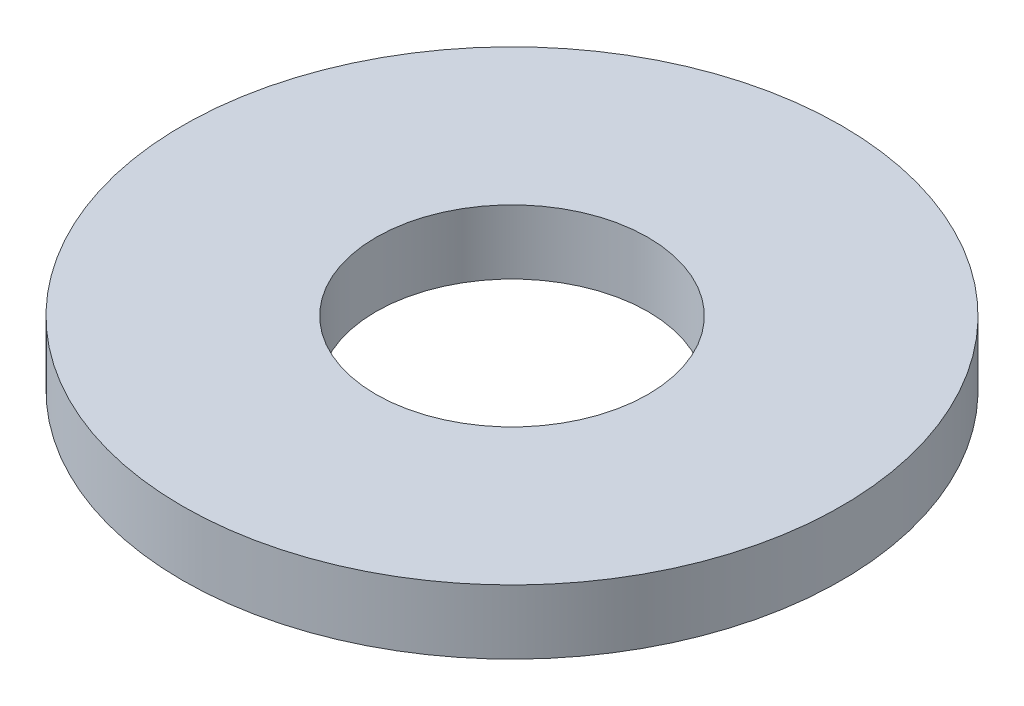
ISO-10303-21;
HEADER;
FILE_DESCRIPTION(('STEP AP214'),'2;1');
FILE_NAME('part.step','',(''),(''),'','','');
FILE_SCHEMA(('AUTOMOTIVE_DESIGN { 1 0 10303 214 1 1 1 1 }'));
ENDSEC;
DATA;
#1=APPLICATION_CONTEXT('core data for automotive mechanical design processes');
#2=APPLICATION_PROTOCOL_DEFINITION('international standard','automotive_design',2000,#1);
#3=PRODUCT_CONTEXT('',#1,'mechanical');
#4=PRODUCT('Part','Part','',(#3));
#5=PRODUCT_RELATED_PRODUCT_CATEGORY('part','',(#4));
#6=PRODUCT_DEFINITION_FORMATION('','',#4);
#7=PRODUCT_DEFINITION_CONTEXT('part definition',#1,'design');
#8=PRODUCT_DEFINITION('design','',#6,#7);
#9=PRODUCT_DEFINITION_SHAPE('','',#8);
#10=(LENGTH_UNIT() NAMED_UNIT(*) SI_UNIT(.MILLI.,.METRE.));
#11=(NAMED_UNIT(*) PLANE_ANGLE_UNIT() SI_UNIT($,.RADIAN.));
#12=(NAMED_UNIT(*) SI_UNIT($,.STERADIAN.) SOLID_ANGLE_UNIT());
#13=UNCERTAINTY_MEASURE_WITH_UNIT(LENGTH_MEASURE(1.E-05),#10,'distance_accuracy_value','');
#14=(GEOMETRIC_REPRESENTATION_CONTEXT(3) GLOBAL_UNCERTAINTY_ASSIGNED_CONTEXT((#13)) GLOBAL_UNIT_ASSIGNED_CONTEXT((#10,
#11,#12)) REPRESENTATION_CONTEXT('',''));
#15=CARTESIAN_POINT('',(0.,0.,0.));
#16=DIRECTION('',(0.,0.,1.));
#17=DIRECTION('',(1.,0.,0.));
#18=AXIS2_PLACEMENT_3D('',#15,#16,#17);
#19=CARTESIAN_POINT('',(0.,1.56,0.));
#20=DIRECTION('',(0.,1.,0.));
#21=DIRECTION('',(0.,0.,-1.));
#22=AXIS2_PLACEMENT_3D('',#19,#20,#21);
#23=PLANE('',#22);
#24=CARTESIAN_POINT('',(0.,1.56,0.));
#25=DIRECTION('',(0.,-1.,0.));
#26=DIRECTION('',(0.,0.,-1.));
#27=AXIS2_PLACEMENT_3D('',#24,#25,#26);
#28=CIRCLE('',#27,8.);
#29=CARTESIAN_POINT('',(0.,1.56,8.));
#30=VERTEX_POINT('',#29);
#31=EDGE_CURVE('E10',#30,#30,#28,.T.);
#32=ORIENTED_EDGE('',*,*,#31,.F.);
#33=EDGE_LOOP('',(#32));
#34=FACE_BOUND('',#33,.T.);
#35=CARTESIAN_POINT('',(0.,1.56,0.));
#36=DIRECTION('',(0.,-1.,0.));
#37=DIRECTION('',(0.,0.,-1.));
#38=AXIS2_PLACEMENT_3D('',#35,#36,#37);
#39=CIRCLE('',#38,3.302);
#40=CARTESIAN_POINT('',(0.,1.56,3.302));
#41=VERTEX_POINT('',#40);
#42=EDGE_CURVE('E44',#41,#41,#39,.T.);
#43=ORIENTED_EDGE('',*,*,#42,.T.);
#44=EDGE_LOOP('',(#43));
#45=FACE_BOUND('',#44,.T.);
#46=ADVANCED_FACE('F33',(#34,#45),#23,.T.);
#47=CARTESIAN_POINT('',(0.,0.,0.));
#48=DIRECTION('',(0.,1.,0.));
#49=DIRECTION('',(0.,0.,-1.));
#50=AXIS2_PLACEMENT_3D('',#47,#48,#49);
#51=PLANE('',#50);
#52=CARTESIAN_POINT('',(0.,0.,0.));
#53=DIRECTION('',(0.,-1.,0.));
#54=DIRECTION('',(0.,0.,-1.));
#55=AXIS2_PLACEMENT_3D('',#52,#53,#54);
#56=CIRCLE('',#55,8.);
#57=CARTESIAN_POINT('',(0.,0.,8.));
#58=VERTEX_POINT('',#57);
#59=EDGE_CURVE('E37',#58,#58,#56,.T.);
#60=ORIENTED_EDGE('',*,*,#59,.T.);
#61=EDGE_LOOP('',(#60));
#62=FACE_BOUND('',#61,.T.);
#63=CARTESIAN_POINT('',(0.,0.,0.));
#64=DIRECTION('',(0.,-1.,0.));
#65=DIRECTION('',(0.,0.,-1.));
#66=AXIS2_PLACEMENT_3D('',#63,#64,#65);
#67=CIRCLE('',#66,3.302);
#68=CARTESIAN_POINT('',(0.,0.,3.302));
#69=VERTEX_POINT('',#68);
#70=EDGE_CURVE('E46',#69,#69,#67,.T.);
#71=ORIENTED_EDGE('',*,*,#70,.F.);
#72=EDGE_LOOP('',(#71));
#73=FACE_BOUND('',#72,.T.);
#74=ADVANCED_FACE('F59',(#62,#73),#51,.F.);
#75=CARTESIAN_POINT('',(0.,1.56,0.));
#76=DIRECTION('',(0.,-1.,0.));
#77=DIRECTION('',(0.,0.,1.));
#78=AXIS2_PLACEMENT_3D('',#75,#76,#77);
#79=CYLINDRICAL_SURFACE('',#78,8.);
#80=CARTESIAN_POINT('',(0.,1.56,8.));
#81=CARTESIAN_POINT('',(0.,1.54375,8.));
#82=CARTESIAN_POINT('',(0.,1.5275,8.));
#83=CARTESIAN_POINT('',(0.,1.495,8.));
#84=CARTESIAN_POINT('',(0.,1.47875,8.));
#85=CARTESIAN_POINT('',(0.,1.44625,8.));
#86=CARTESIAN_POINT('',(0.,1.43,8.));
#87=CARTESIAN_POINT('',(0.,1.3975,8.));
#88=CARTESIAN_POINT('',(0.,1.38125,8.));
#89=CARTESIAN_POINT('',(0.,1.34875,8.));
#90=CARTESIAN_POINT('',(0.,1.3325,8.));
#91=CARTESIAN_POINT('',(0.,1.3,8.));
#92=CARTESIAN_POINT('',(0.,1.28375,8.));
#93=CARTESIAN_POINT('',(0.,1.25125,8.));
#94=CARTESIAN_POINT('',(0.,1.235,8.));
#95=CARTESIAN_POINT('',(0.,1.2025,8.));
#96=CARTESIAN_POINT('',(0.,1.18625,8.));
#97=CARTESIAN_POINT('',(0.,1.15375,8.));
#98=CARTESIAN_POINT('',(0.,1.1375,8.));
#99=CARTESIAN_POINT('',(0.,1.105,8.));
#100=CARTESIAN_POINT('',(0.,1.08875,8.));
#101=CARTESIAN_POINT('',(0.,1.05625,8.));
#102=CARTESIAN_POINT('',(0.,1.04,8.));
#103=CARTESIAN_POINT('',(0.,1.0075,8.));
#104=CARTESIAN_POINT('',(0.,0.99125,8.));
#105=CARTESIAN_POINT('',(0.,0.95875,8.));
#106=CARTESIAN_POINT('',(0.,0.9425,8.));
#107=CARTESIAN_POINT('',(0.,0.91,8.));
#108=CARTESIAN_POINT('',(0.,0.89375,8.));
#109=CARTESIAN_POINT('',(0.,0.86125,8.));
#110=CARTESIAN_POINT('',(0.,0.845,8.));
#111=CARTESIAN_POINT('',(0.,0.8125,8.));
#112=CARTESIAN_POINT('',(0.,0.79625,8.));
#113=CARTESIAN_POINT('',(0.,0.76375,8.));
#114=CARTESIAN_POINT('',(0.,0.7475,8.));
#115=CARTESIAN_POINT('',(0.,0.715,8.));
#116=CARTESIAN_POINT('',(0.,0.69875,8.));
#117=CARTESIAN_POINT('',(0.,0.66625,8.));
#118=CARTESIAN_POINT('',(0.,0.65,8.));
#119=CARTESIAN_POINT('',(0.,0.6175,8.));
#120=CARTESIAN_POINT('',(0.,0.60125,8.));
#121=CARTESIAN_POINT('',(0.,0.56875,8.));
#122=CARTESIAN_POINT('',(0.,0.5525,8.));
#123=CARTESIAN_POINT('',(0.,0.52,8.));
#124=CARTESIAN_POINT('',(0.,0.50375,8.));
#125=CARTESIAN_POINT('',(0.,0.47125,8.));
#126=CARTESIAN_POINT('',(0.,0.455,8.));
#127=CARTESIAN_POINT('',(0.,0.4225,8.));
#128=CARTESIAN_POINT('',(0.,0.40625,8.));
#129=CARTESIAN_POINT('',(0.,0.37375,8.));
#130=CARTESIAN_POINT('',(0.,0.3575,8.));
#131=CARTESIAN_POINT('',(0.,0.325,8.));
#132=CARTESIAN_POINT('',(0.,0.30875,8.));
#133=CARTESIAN_POINT('',(0.,0.27625,8.));
#134=CARTESIAN_POINT('',(0.,0.26,8.));
#135=CARTESIAN_POINT('',(0.,0.2275,8.));
#136=CARTESIAN_POINT('',(0.,0.21125,8.));
#137=CARTESIAN_POINT('',(0.,0.17875,8.));
#138=CARTESIAN_POINT('',(0.,0.1625,8.));
#139=CARTESIAN_POINT('',(0.,0.13,8.));
#140=CARTESIAN_POINT('',(0.,0.11375,8.));
#141=CARTESIAN_POINT('',(0.,0.0812499999999999,8.));
#142=CARTESIAN_POINT('',(0.,0.0649999999999999,8.));
#143=CARTESIAN_POINT('',(0.,0.0325,8.));
#144=CARTESIAN_POINT('',(0.,0.01625,8.));
#145=CARTESIAN_POINT('',(0.,0.,8.));
#146=B_SPLINE_CURVE_WITH_KNOTS('',3,(#80,#81,#82,#83,#84,#85,#86,#87,#88,#89,#90,#91,#92,#93,
#94,#95,#96,#97,#98,#99,#100,#101,#102,#103,#104,#105,#106,#107,#108,#109,#110,#111,#112,#113,
#114,#115,#116,#117,#118,#119,#120,#121,#122,#123,#124,#125,#126,#127,#128,#129,#130,#131,#132,
#133,#134,#135,#136,#137,#138,#139,#140,#141,#142,#143,#144,#145),.UNSPECIFIED.,.F.,.F.,(4,2,2,
2,2,2,2,2,2,2,2,2,2,2,2,2,2,2,2,2,2,2,2,2,2,2,2,2,2,2,2,2,4),(0.,0.04875,0.0974999999999999,
0.14625,0.195,0.24375,0.2925,0.34125,0.39,0.43875,0.4875,0.53625,0.585,0.63375,0.6825,0.73125,
0.78,0.82875,0.8775,0.92625,0.975,1.02375,1.0725,1.12125,1.17,1.21875,1.2675,1.31625,1.365,
1.41375,1.4625,1.51125,1.56),.UNSPECIFIED.);
#147=EDGE_CURVE('BSEAM35',#30,#58,#146,.T.);
#148=ORIENTED_EDGE('',*,*,#31,.T.);
#149=ORIENTED_EDGE('',*,*,#59,.F.);
#150=ORIENTED_EDGE('',*,*,#147,.T.);
#151=ORIENTED_EDGE('',*,*,#147,.F.);
#152=EDGE_LOOP('',(#148,#150,#149,#151));
#153=FACE_BOUND('',#152,.T.);
#154=ADVANCED_FACE('F35',(#153),#79,.T.);
#155=CARTESIAN_POINT('',(0.,1.56,0.));
#156=DIRECTION('',(0.,-1.,0.));
#157=DIRECTION('',(0.,0.,1.));
#158=AXIS2_PLACEMENT_3D('',#155,#156,#157);
#159=CYLINDRICAL_SURFACE('',#158,3.302);
#160=CARTESIAN_POINT('',(0.,1.56,3.302));
#161=CARTESIAN_POINT('',(0.,1.54375,3.302));
#162=CARTESIAN_POINT('',(0.,1.5275,3.302));
#163=CARTESIAN_POINT('',(0.,1.495,3.302));
#164=CARTESIAN_POINT('',(0.,1.47875,3.302));
#165=CARTESIAN_POINT('',(0.,1.44625,3.302));
#166=CARTESIAN_POINT('',(0.,1.43,3.302));
#167=CARTESIAN_POINT('',(0.,1.3975,3.302));
#168=CARTESIAN_POINT('',(0.,1.38125,3.302));
#169=CARTESIAN_POINT('',(0.,1.34875,3.302));
#170=CARTESIAN_POINT('',(0.,1.3325,3.302));
#171=CARTESIAN_POINT('',(0.,1.3,3.302));
#172=CARTESIAN_POINT('',(0.,1.28375,3.302));
#173=CARTESIAN_POINT('',(0.,1.25125,3.302));
#174=CARTESIAN_POINT('',(0.,1.235,3.302));
#175=CARTESIAN_POINT('',(0.,1.2025,3.302));
#176=CARTESIAN_POINT('',(0.,1.18625,3.302));
#177=CARTESIAN_POINT('',(0.,1.15375,3.302));
#178=CARTESIAN_POINT('',(0.,1.1375,3.302));
#179=CARTESIAN_POINT('',(0.,1.105,3.302));
#180=CARTESIAN_POINT('',(0.,1.08875,3.302));
#181=CARTESIAN_POINT('',(0.,1.05625,3.302));
#182=CARTESIAN_POINT('',(0.,1.04,3.302));
#183=CARTESIAN_POINT('',(0.,1.0075,3.302));
#184=CARTESIAN_POINT('',(0.,0.99125,3.302));
#185=CARTESIAN_POINT('',(0.,0.95875,3.302));
#186=CARTESIAN_POINT('',(0.,0.9425,3.302));
#187=CARTESIAN_POINT('',(0.,0.91,3.302));
#188=CARTESIAN_POINT('',(0.,0.89375,3.302));
#189=CARTESIAN_POINT('',(0.,0.86125,3.302));
#190=CARTESIAN_POINT('',(0.,0.845,3.302));
#191=CARTESIAN_POINT('',(0.,0.8125,3.302));
#192=CARTESIAN_POINT('',(0.,0.79625,3.302));
#193=CARTESIAN_POINT('',(0.,0.76375,3.302));
#194=CARTESIAN_POINT('',(0.,0.7475,3.302));
#195=CARTESIAN_POINT('',(0.,0.715,3.302));
#196=CARTESIAN_POINT('',(0.,0.69875,3.302));
#197=CARTESIAN_POINT('',(0.,0.66625,3.302));
#198=CARTESIAN_POINT('',(0.,0.65,3.302));
#199=CARTESIAN_POINT('',(0.,0.6175,3.302));
#200=CARTESIAN_POINT('',(0.,0.60125,3.302));
#201=CARTESIAN_POINT('',(0.,0.56875,3.302));
#202=CARTESIAN_POINT('',(0.,0.5525,3.302));
#203=CARTESIAN_POINT('',(0.,0.52,3.302));
#204=CARTESIAN_POINT('',(0.,0.50375,3.302));
#205=CARTESIAN_POINT('',(0.,0.47125,3.302));
#206=CARTESIAN_POINT('',(0.,0.455,3.302));
#207=CARTESIAN_POINT('',(0.,0.4225,3.302));
#208=CARTESIAN_POINT('',(0.,0.40625,3.302));
#209=CARTESIAN_POINT('',(0.,0.37375,3.302));
#210=CARTESIAN_POINT('',(0.,0.3575,3.302));
#211=CARTESIAN_POINT('',(0.,0.325,3.302));
#212=CARTESIAN_POINT('',(0.,0.30875,3.302));
#213=CARTESIAN_POINT('',(0.,0.27625,3.302));
#214=CARTESIAN_POINT('',(0.,0.26,3.302));
#215=CARTESIAN_POINT('',(0.,0.2275,3.302));
#216=CARTESIAN_POINT('',(0.,0.21125,3.302));
#217=CARTESIAN_POINT('',(0.,0.17875,3.302));
#218=CARTESIAN_POINT('',(0.,0.1625,3.302));
#219=CARTESIAN_POINT('',(0.,0.13,3.302));
#220=CARTESIAN_POINT('',(0.,0.11375,3.302));
#221=CARTESIAN_POINT('',(0.,0.0812499999999999,3.302));
#222=CARTESIAN_POINT('',(0.,0.0649999999999999,3.302));
#223=CARTESIAN_POINT('',(0.,0.0325,3.302));
#224=CARTESIAN_POINT('',(0.,0.01625,3.302));
#225=CARTESIAN_POINT('',(0.,0.,3.302));
#226=B_SPLINE_CURVE_WITH_KNOTS('',3,(#160,#161,#162,#163,#164,#165,#166,#167,#168,#169,#170,
#171,#172,#173,#174,#175,#176,#177,#178,#179,#180,#181,#182,#183,#184,#185,#186,#187,#188,#189,
#190,#191,#192,#193,#194,#195,#196,#197,#198,#199,#200,#201,#202,#203,#204,#205,#206,#207,#208,
#209,#210,#211,#212,#213,#214,#215,#216,#217,#218,#219,#220,#221,#222,#223,#224,#225),
.UNSPECIFIED.,.F.,.F.,(4,2,2,2,2,2,2,2,2,2,2,2,2,2,2,2,2,2,2,2,2,2,2,2,2,2,2,2,2,2,2,2,4),(0.,
0.04875,0.0974999999999999,0.14625,0.195,0.24375,0.2925,0.34125,0.39,0.43875,0.4875,0.53625,
0.585,0.63375,0.6825,0.73125,0.78,0.82875,0.8775,0.92625,0.975,1.02375,1.0725,1.12125,1.17,
1.21875,1.2675,1.31625,1.365,1.41375,1.4625,1.51125,1.56),.UNSPECIFIED.);
#227=EDGE_CURVE('BSEAM53',#41,#69,#226,.T.);
#228=ORIENTED_EDGE('',*,*,#42,.F.);
#229=ORIENTED_EDGE('',*,*,#70,.T.);
#230=ORIENTED_EDGE('',*,*,#227,.T.);
#231=ORIENTED_EDGE('',*,*,#227,.F.);
#232=EDGE_LOOP('',(#228,#230,#229,#231));
#233=FACE_BOUND('',#232,.T.);
#234=ADVANCED_FACE('F53',(#233),#159,.F.);
#235=CLOSED_SHELL('',(#46,#74,#154,#234));
#236=MANIFOLD_SOLID_BREP('B2',#235);
#237=ADVANCED_BREP_SHAPE_REPRESENTATION('',(#18,#236),#14);
#238=SHAPE_DEFINITION_REPRESENTATION(#9,#237);
ENDSEC;
END-ISO-10303-21;
